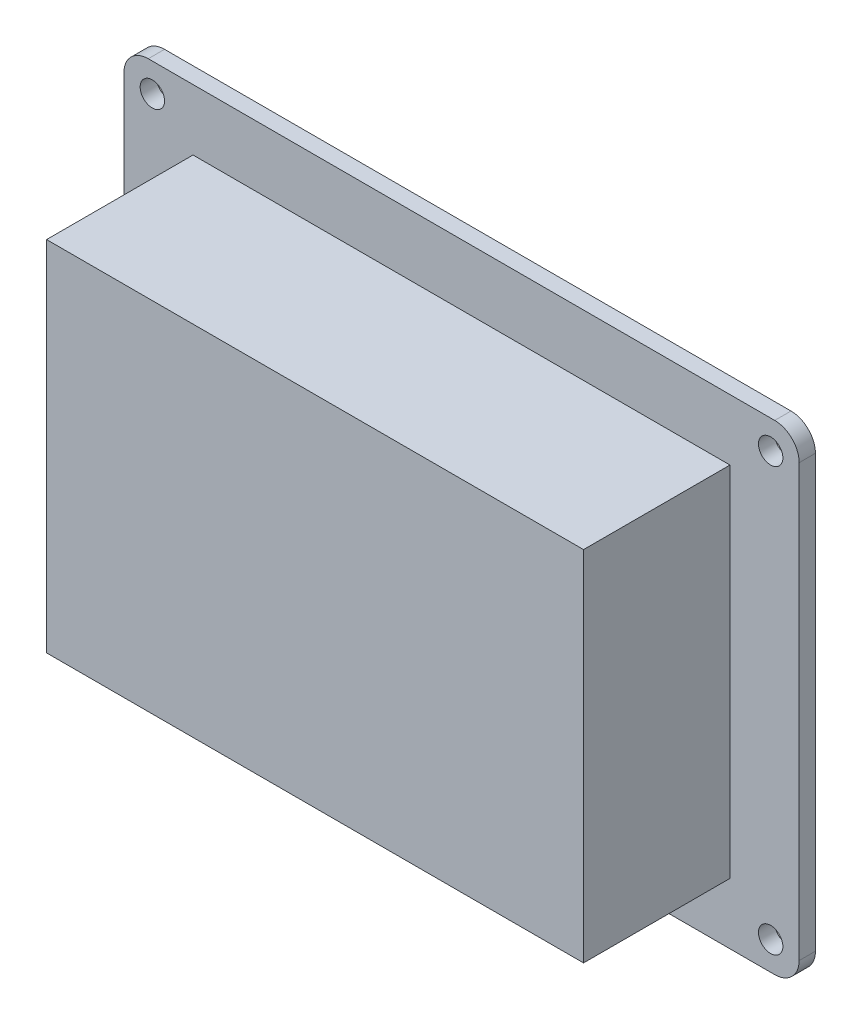
ISO-10303-21;
HEADER;
FILE_DESCRIPTION(('STEP AP214'),'2;1');
FILE_NAME('part.step','',(''),(''),'','','');
FILE_SCHEMA(('AUTOMOTIVE_DESIGN { 1 0 10303 214 1 1 1 1 }'));
ENDSEC;
DATA;
#1=APPLICATION_CONTEXT('core data for automotive mechanical design processes');
#2=APPLICATION_PROTOCOL_DEFINITION('international standard','automotive_design',2000,#1);
#3=PRODUCT_CONTEXT('',#1,'mechanical');
#4=PRODUCT('Part','Part','',(#3));
#5=PRODUCT_RELATED_PRODUCT_CATEGORY('part','',(#4));
#6=PRODUCT_DEFINITION_FORMATION('','',#4);
#7=PRODUCT_DEFINITION_CONTEXT('part definition',#1,'design');
#8=PRODUCT_DEFINITION('design','',#6,#7);
#9=PRODUCT_DEFINITION_SHAPE('','',#8);
#10=(LENGTH_UNIT() NAMED_UNIT(*) SI_UNIT(.MILLI.,.METRE.));
#11=(NAMED_UNIT(*) PLANE_ANGLE_UNIT() SI_UNIT($,.RADIAN.));
#12=(NAMED_UNIT(*) SI_UNIT($,.STERADIAN.) SOLID_ANGLE_UNIT());
#13=UNCERTAINTY_MEASURE_WITH_UNIT(LENGTH_MEASURE(1.E-05),#10,'distance_accuracy_value','');
#14=(GEOMETRIC_REPRESENTATION_CONTEXT(3) GLOBAL_UNCERTAINTY_ASSIGNED_CONTEXT((#13)) GLOBAL_UNIT_ASSIGNED_CONTEXT((#10,
#11,#12)) REPRESENTATION_CONTEXT('',''));
#15=CARTESIAN_POINT('',(0.,0.,0.));
#16=DIRECTION('',(0.,0.,1.));
#17=DIRECTION('',(1.,0.,0.));
#18=AXIS2_PLACEMENT_3D('',#15,#16,#17);
#19=CARTESIAN_POINT('',(0.,0.,2.));
#20=DIRECTION('',(0.,0.,-1.));
#21=DIRECTION('',(-1.,0.,0.));
#22=AXIS2_PLACEMENT_3D('',#19,#20,#21);
#23=PLANE('',#22);
#24=DIRECTION('',(0.,1.,0.));
#25=VECTOR('',#24,1.);
#26=CARTESIAN_POINT('',(83.,0.,2.));
#27=LINE('',#26,#25);
#28=CARTESIAN_POINT('',(83.,3.,2.));
#29=VERTEX_POINT('',#28);
#30=CARTESIAN_POINT('',(83.,56.,2.));
#31=VERTEX_POINT('',#30);
#32=EDGE_CURVE('E181',#29,#31,#27,.T.);
#33=ORIENTED_EDGE('',*,*,#32,.T.);
#34=CARTESIAN_POINT('',(80.,56.,2.));
#35=DIRECTION('',(0.,0.,-1.));
#36=DIRECTION('',(-1.,0.,0.));
#37=AXIS2_PLACEMENT_3D('',#34,#35,#36);
#38=CIRCLE('',#37,3.);
#39=CARTESIAN_POINT('',(80.,59.,2.));
#40=VERTEX_POINT('',#39);
#41=EDGE_CURVE('E221',#31,#40,#38,.F.);
#42=ORIENTED_EDGE('',*,*,#41,.T.);
#43=DIRECTION('',(-1.,0.,0.));
#44=VECTOR('',#43,1.);
#45=CARTESIAN_POINT('',(0.,59.,2.));
#46=LINE('',#45,#44);
#47=CARTESIAN_POINT('',(3.,59.,2.));
#48=VERTEX_POINT('',#47);
#49=EDGE_CURVE('E184',#40,#48,#46,.T.);
#50=ORIENTED_EDGE('',*,*,#49,.T.);
#51=CARTESIAN_POINT('',(3.,56.,2.));
#52=DIRECTION('',(0.,0.,-1.));
#53=DIRECTION('',(-1.,0.,0.));
#54=AXIS2_PLACEMENT_3D('',#51,#52,#53);
#55=CIRCLE('',#54,3.);
#56=CARTESIAN_POINT('',(0.,56.,2.));
#57=VERTEX_POINT('',#56);
#58=EDGE_CURVE('E215',#48,#57,#55,.F.);
#59=ORIENTED_EDGE('',*,*,#58,.T.);
#60=DIRECTION('',(0.,-1.,0.));
#61=VECTOR('',#60,1.);
#62=CARTESIAN_POINT('',(0.,0.,2.));
#63=LINE('',#62,#61);
#64=CARTESIAN_POINT('',(0.,3.,2.));
#65=VERTEX_POINT('',#64);
#66=EDGE_CURVE('E174',#57,#65,#63,.T.);
#67=ORIENTED_EDGE('',*,*,#66,.T.);
#68=CARTESIAN_POINT('',(3.,3.,2.));
#69=DIRECTION('',(0.,0.,-1.));
#70=DIRECTION('',(-1.,0.,0.));
#71=AXIS2_PLACEMENT_3D('',#68,#69,#70);
#72=CIRCLE('',#71,3.);
#73=CARTESIAN_POINT('',(3.,0.,2.));
#74=VERTEX_POINT('',#73);
#75=EDGE_CURVE('E217',#65,#74,#72,.F.);
#76=ORIENTED_EDGE('',*,*,#75,.T.);
#77=DIRECTION('',(1.,0.,0.));
#78=VECTOR('',#77,1.);
#79=CARTESIAN_POINT('',(0.,0.,2.));
#80=LINE('',#79,#78);
#81=CARTESIAN_POINT('',(80.,0.,2.));
#82=VERTEX_POINT('',#81);
#83=EDGE_CURVE('E177',#74,#82,#80,.T.);
#84=ORIENTED_EDGE('',*,*,#83,.T.);
#85=CARTESIAN_POINT('',(80.,3.,2.));
#86=DIRECTION('',(0.,0.,-1.));
#87=DIRECTION('',(-1.,0.,0.));
#88=AXIS2_PLACEMENT_3D('',#85,#86,#87);
#89=CIRCLE('',#88,3.);
#90=EDGE_CURVE('E219',#82,#29,#89,.F.);
#91=ORIENTED_EDGE('',*,*,#90,.T.);
#92=EDGE_LOOP('',(#33,#42,#50,#59,#67,#76,#84,#91));
#93=FACE_BOUND('',#92,.T.);
#94=CARTESIAN_POINT('',(79.5,55.5,2.));
#95=DIRECTION('',(0.,0.,1.));
#96=DIRECTION('',(1.,0.,0.));
#97=AXIS2_PLACEMENT_3D('',#94,#95,#96);
#98=CIRCLE('',#97,1.5);
#99=CARTESIAN_POINT('',(81.,55.5,2.));
#100=VERTEX_POINT('',#99);
#101=EDGE_CURVE('E158',#100,#100,#98,.T.);
#102=ORIENTED_EDGE('',*,*,#101,.F.);
#103=EDGE_LOOP('',(#102));
#104=FACE_BOUND('',#103,.T.);
#105=CARTESIAN_POINT('',(3.50000000000002,55.5,2.));
#106=DIRECTION('',(0.,0.,1.));
#107=DIRECTION('',(1.,0.,0.));
#108=AXIS2_PLACEMENT_3D('',#105,#106,#107);
#109=CIRCLE('',#108,1.5);
#110=CARTESIAN_POINT('',(5.00000000000002,55.5,2.));
#111=VERTEX_POINT('',#110);
#112=EDGE_CURVE('E162',#111,#111,#109,.T.);
#113=ORIENTED_EDGE('',*,*,#112,.F.);
#114=EDGE_LOOP('',(#113));
#115=FACE_BOUND('',#114,.T.);
#116=CARTESIAN_POINT('',(79.5,3.5,2.));
#117=DIRECTION('',(0.,0.,-1.));
#118=DIRECTION('',(1.,0.,0.));
#119=AXIS2_PLACEMENT_3D('',#116,#117,#118);
#120=CIRCLE('',#119,1.5);
#121=CARTESIAN_POINT('',(81.,3.5,2.));
#122=VERTEX_POINT('',#121);
#123=EDGE_CURVE('E144',#122,#122,#120,.T.);
#124=ORIENTED_EDGE('',*,*,#123,.T.);
#125=EDGE_LOOP('',(#124));
#126=FACE_BOUND('',#125,.T.);
#127=CARTESIAN_POINT('',(3.50000000000002,3.5,2.));
#128=DIRECTION('',(0.,0.,-1.));
#129=DIRECTION('',(1.,0.,0.));
#130=AXIS2_PLACEMENT_3D('',#127,#128,#129);
#131=CIRCLE('',#130,1.5);
#132=CARTESIAN_POINT('',(5.00000000000002,3.5,2.));
#133=VERTEX_POINT('',#132);
#134=EDGE_CURVE('E153',#133,#133,#131,.T.);
#135=ORIENTED_EDGE('',*,*,#134,.T.);
#136=EDGE_LOOP('',(#135));
#137=FACE_BOUND('',#136,.T.);
#138=DIRECTION('',(0.,-1.,0.));
#139=VECTOR('',#138,1.);
#140=CARTESIAN_POINT('',(8.50000000000001,51.5,2.));
#141=LINE('',#140,#139);
#142=CARTESIAN_POINT('',(8.50000000000001,51.5,2.));
#143=VERTEX_POINT('',#142);
#144=CARTESIAN_POINT('',(8.50000000000001,7.5,2.));
#145=VERTEX_POINT('',#144);
#146=EDGE_CURVE('E143',#143,#145,#141,.T.);
#147=ORIENTED_EDGE('',*,*,#146,.F.);
#148=DIRECTION('',(-1.,0.,0.));
#149=VECTOR('',#148,1.);
#150=CARTESIAN_POINT('',(8.50000000000001,51.5,2.));
#151=LINE('',#150,#149);
#152=CARTESIAN_POINT('',(74.5,51.5,2.));
#153=VERTEX_POINT('',#152);
#154=EDGE_CURVE('E140',#153,#143,#151,.T.);
#155=ORIENTED_EDGE('',*,*,#154,.F.);
#156=DIRECTION('',(0.,1.,0.));
#157=VECTOR('',#156,1.);
#158=CARTESIAN_POINT('',(74.5,51.5,2.));
#159=LINE('',#158,#157);
#160=CARTESIAN_POINT('',(74.5,7.5,2.));
#161=VERTEX_POINT('',#160);
#162=EDGE_CURVE('E55',#161,#153,#159,.T.);
#163=ORIENTED_EDGE('',*,*,#162,.F.);
#164=DIRECTION('',(1.,0.,0.));
#165=VECTOR('',#164,1.);
#166=CARTESIAN_POINT('',(8.50000000000001,7.5,2.));
#167=LINE('',#166,#165);
#168=EDGE_CURVE('E50',#145,#161,#167,.T.);
#169=ORIENTED_EDGE('',*,*,#168,.F.);
#170=EDGE_LOOP('',(#147,#155,#163,#169));
#171=FACE_BOUND('',#170,.T.);
#172=ADVANCED_FACE('F35',(#93,#104,#115,#126,#137,#171),#23,.F.);
#173=CARTESIAN_POINT('',(0.,0.,2.));
#174=DIRECTION('',(1.,0.,0.));
#175=DIRECTION('',(0.,0.,-1.));
#176=AXIS2_PLACEMENT_3D('',#173,#174,#175);
#177=PLANE('',#176);
#178=DIRECTION('',(0.,-1.,0.));
#179=VECTOR('',#178,1.);
#180=CARTESIAN_POINT('',(0.,0.,0.));
#181=LINE('',#180,#179);
#182=CARTESIAN_POINT('',(0.,56.,0.));
#183=VERTEX_POINT('',#182);
#184=CARTESIAN_POINT('',(0.,3.,0.));
#185=VERTEX_POINT('',#184);
#186=EDGE_CURVE('E165',#183,#185,#181,.T.);
#187=ORIENTED_EDGE('',*,*,#186,.T.);
#188=DIRECTION('',(0.,0.,-1.));
#189=VECTOR('',#188,1.);
#190=CARTESIAN_POINT('',(0.,3.,2.));
#191=LINE('',#190,#189);
#192=EDGE_CURVE('E11',#185,#65,#191,.F.);
#193=ORIENTED_EDGE('',*,*,#192,.T.);
#194=ORIENTED_EDGE('',*,*,#66,.F.);
#195=DIRECTION('',(0.,0.,-1.));
#196=VECTOR('',#195,1.);
#197=CARTESIAN_POINT('',(0.,56.,2.));
#198=LINE('',#197,#196);
#199=EDGE_CURVE('E43',#57,#183,#198,.T.);
#200=ORIENTED_EDGE('',*,*,#199,.T.);
#201=EDGE_LOOP('',(#187,#193,#194,#200));
#202=FACE_BOUND('',#201,.T.);
#203=ADVANCED_FACE('F232',(#202),#177,.F.);
#204=CARTESIAN_POINT('',(0.,0.,2.));
#205=DIRECTION('',(0.,1.,0.));
#206=DIRECTION('',(0.,0.,1.));
#207=AXIS2_PLACEMENT_3D('',#204,#205,#206);
#208=PLANE('',#207);
#209=DIRECTION('',(1.,0.,0.));
#210=VECTOR('',#209,1.);
#211=CARTESIAN_POINT('',(0.,0.,0.));
#212=LINE('',#211,#210);
#213=CARTESIAN_POINT('',(3.,0.,0.));
#214=VERTEX_POINT('',#213);
#215=CARTESIAN_POINT('',(80.,0.,0.));
#216=VERTEX_POINT('',#215);
#217=EDGE_CURVE('E190',#214,#216,#212,.T.);
#218=ORIENTED_EDGE('',*,*,#217,.T.);
#219=DIRECTION('',(0.,0.,-1.));
#220=VECTOR('',#219,1.);
#221=CARTESIAN_POINT('',(80.,0.,2.));
#222=LINE('',#221,#220);
#223=EDGE_CURVE('E226',#216,#82,#222,.F.);
#224=ORIENTED_EDGE('',*,*,#223,.T.);
#225=ORIENTED_EDGE('',*,*,#83,.F.);
#226=DIRECTION('',(0.,0.,-1.));
#227=VECTOR('',#226,1.);
#228=CARTESIAN_POINT('',(3.,0.,2.));
#229=LINE('',#228,#227);
#230=EDGE_CURVE('E223',#74,#214,#229,.T.);
#231=ORIENTED_EDGE('',*,*,#230,.T.);
#232=EDGE_LOOP('',(#218,#224,#225,#231));
#233=FACE_BOUND('',#232,.T.);
#234=ADVANCED_FACE('F246',(#233),#208,.F.);
#235=CARTESIAN_POINT('',(83.,0.,2.));
#236=DIRECTION('',(-1.,0.,0.));
#237=DIRECTION('',(0.,-1.,0.));
#238=AXIS2_PLACEMENT_3D('',#235,#236,#237);
#239=PLANE('',#238);
#240=DIRECTION('',(0.,1.,0.));
#241=VECTOR('',#240,1.);
#242=CARTESIAN_POINT('',(83.,0.,0.));
#243=LINE('',#242,#241);
#244=CARTESIAN_POINT('',(83.,3.,0.));
#245=VERTEX_POINT('',#244);
#246=CARTESIAN_POINT('',(83.,56.,0.));
#247=VERTEX_POINT('',#246);
#248=EDGE_CURVE('E193',#245,#247,#243,.T.);
#249=ORIENTED_EDGE('',*,*,#248,.T.);
#250=DIRECTION('',(0.,0.,-1.));
#251=VECTOR('',#250,1.);
#252=CARTESIAN_POINT('',(83.,56.,2.));
#253=LINE('',#252,#251);
#254=EDGE_CURVE('E213',#247,#31,#253,.F.);
#255=ORIENTED_EDGE('',*,*,#254,.T.);
#256=ORIENTED_EDGE('',*,*,#32,.F.);
#257=DIRECTION('',(0.,0.,-1.));
#258=VECTOR('',#257,1.);
#259=CARTESIAN_POINT('',(83.,3.,2.));
#260=LINE('',#259,#258);
#261=EDGE_CURVE('E210',#29,#245,#260,.T.);
#262=ORIENTED_EDGE('',*,*,#261,.T.);
#263=EDGE_LOOP('',(#249,#255,#256,#262));
#264=FACE_BOUND('',#263,.T.);
#265=ADVANCED_FACE('F257',(#264),#239,.F.);
#266=CARTESIAN_POINT('',(0.,59.,2.));
#267=DIRECTION('',(0.,-1.,0.));
#268=DIRECTION('',(0.,0.,-1.));
#269=AXIS2_PLACEMENT_3D('',#266,#267,#268);
#270=PLANE('',#269);
#271=ORIENTED_EDGE('',*,*,#49,.F.);
#272=DIRECTION('',(0.,0.,-1.));
#273=VECTOR('',#272,1.);
#274=CARTESIAN_POINT('',(80.,59.,2.));
#275=LINE('',#274,#273);
#276=CARTESIAN_POINT('',(80.,59.,0.));
#277=VERTEX_POINT('',#276);
#278=EDGE_CURVE('E199',#40,#277,#275,.T.);
#279=ORIENTED_EDGE('',*,*,#278,.T.);
#280=DIRECTION('',(-1.,0.,0.));
#281=VECTOR('',#280,1.);
#282=CARTESIAN_POINT('',(0.,59.,0.));
#283=LINE('',#282,#281);
#284=CARTESIAN_POINT('',(3.,59.,0.));
#285=VERTEX_POINT('',#284);
#286=EDGE_CURVE('E178',#277,#285,#283,.T.);
#287=ORIENTED_EDGE('',*,*,#286,.T.);
#288=DIRECTION('',(0.,0.,-1.));
#289=VECTOR('',#288,1.);
#290=CARTESIAN_POINT('',(3.,59.,2.));
#291=LINE('',#290,#289);
#292=EDGE_CURVE('E187',#285,#48,#291,.F.);
#293=ORIENTED_EDGE('',*,*,#292,.T.);
#294=EDGE_LOOP('',(#271,#279,#287,#293));
#295=FACE_BOUND('',#294,.T.);
#296=ADVANCED_FACE('F265',(#295),#270,.F.);
#297=CARTESIAN_POINT('',(0.,0.,0.));
#298=DIRECTION('',(0.,0.,-1.));
#299=DIRECTION('',(-1.,0.,0.));
#300=AXIS2_PLACEMENT_3D('',#297,#298,#299);
#301=PLANE('',#300);
#302=CARTESIAN_POINT('',(3.50000000000002,3.5,0.));
#303=DIRECTION('',(0.,0.,-1.));
#304=DIRECTION('',(-1.,0.,0.));
#305=AXIS2_PLACEMENT_3D('',#302,#303,#304);
#306=CIRCLE('',#305,1.5);
#307=CARTESIAN_POINT('',(2.00000000000002,3.5,0.));
#308=VERTEX_POINT('',#307);
#309=EDGE_CURVE('E156',#308,#308,#306,.T.);
#310=ORIENTED_EDGE('',*,*,#309,.F.);
#311=EDGE_LOOP('',(#310));
#312=FACE_BOUND('',#311,.T.);
#313=CARTESIAN_POINT('',(79.5,3.5,0.));
#314=DIRECTION('',(0.,0.,-1.));
#315=DIRECTION('',(-1.,0.,0.));
#316=AXIS2_PLACEMENT_3D('',#313,#314,#315);
#317=CIRCLE('',#316,1.5);
#318=CARTESIAN_POINT('',(78.,3.5,0.));
#319=VERTEX_POINT('',#318);
#320=EDGE_CURVE('E147',#319,#319,#317,.T.);
#321=ORIENTED_EDGE('',*,*,#320,.F.);
#322=EDGE_LOOP('',(#321));
#323=FACE_BOUND('',#322,.T.);
#324=CARTESIAN_POINT('',(3.50000000000002,55.5,0.));
#325=DIRECTION('',(0.,0.,-1.));
#326=DIRECTION('',(-1.,0.,0.));
#327=AXIS2_PLACEMENT_3D('',#324,#325,#326);
#328=CIRCLE('',#327,1.5);
#329=CARTESIAN_POINT('',(2.00000000000002,55.5,0.));
#330=VERTEX_POINT('',#329);
#331=EDGE_CURVE('E166',#330,#330,#328,.F.);
#332=ORIENTED_EDGE('',*,*,#331,.T.);
#333=EDGE_LOOP('',(#332));
#334=FACE_BOUND('',#333,.T.);
#335=CARTESIAN_POINT('',(79.5,55.5,0.));
#336=DIRECTION('',(0.,0.,-1.));
#337=DIRECTION('',(-1.,0.,0.));
#338=AXIS2_PLACEMENT_3D('',#335,#336,#337);
#339=CIRCLE('',#338,1.5);
#340=CARTESIAN_POINT('',(78.,55.5,0.));
#341=VERTEX_POINT('',#340);
#342=EDGE_CURVE('E169',#341,#341,#339,.F.);
#343=ORIENTED_EDGE('',*,*,#342,.T.);
#344=EDGE_LOOP('',(#343));
#345=FACE_BOUND('',#344,.T.);
#346=ORIENTED_EDGE('',*,*,#286,.F.);
#347=CARTESIAN_POINT('',(80.,56.,0.));
#348=DIRECTION('',(0.,0.,-1.));
#349=DIRECTION('',(-1.,0.,0.));
#350=AXIS2_PLACEMENT_3D('',#347,#348,#349);
#351=CIRCLE('',#350,3.);
#352=EDGE_CURVE('E208',#277,#247,#351,.T.);
#353=ORIENTED_EDGE('',*,*,#352,.T.);
#354=ORIENTED_EDGE('',*,*,#248,.F.);
#355=CARTESIAN_POINT('',(80.,3.,0.));
#356=DIRECTION('',(0.,0.,-1.));
#357=DIRECTION('',(-1.,0.,0.));
#358=AXIS2_PLACEMENT_3D('',#355,#356,#357);
#359=CIRCLE('',#358,3.);
#360=EDGE_CURVE('E206',#245,#216,#359,.T.);
#361=ORIENTED_EDGE('',*,*,#360,.T.);
#362=ORIENTED_EDGE('',*,*,#217,.F.);
#363=CARTESIAN_POINT('',(3.,3.,0.));
#364=DIRECTION('',(0.,0.,-1.));
#365=DIRECTION('',(-1.,0.,0.));
#366=AXIS2_PLACEMENT_3D('',#363,#364,#365);
#367=CIRCLE('',#366,3.);
#368=EDGE_CURVE('E204',#214,#185,#367,.T.);
#369=ORIENTED_EDGE('',*,*,#368,.T.);
#370=ORIENTED_EDGE('',*,*,#186,.F.);
#371=CARTESIAN_POINT('',(3.,56.,0.));
#372=DIRECTION('',(0.,0.,-1.));
#373=DIRECTION('',(-1.,0.,0.));
#374=AXIS2_PLACEMENT_3D('',#371,#372,#373);
#375=CIRCLE('',#374,3.);
#376=EDGE_CURVE('E202',#183,#285,#375,.T.);
#377=ORIENTED_EDGE('',*,*,#376,.T.);
#378=EDGE_LOOP('',(#346,#353,#354,#361,#362,#369,#370,#377));
#379=FACE_BOUND('',#378,.T.);
#380=ADVANCED_FACE('F238',(#312,#323,#334,#345,#379),#301,.T.);
#381=CARTESIAN_POINT('',(80.,56.,2.));
#382=DIRECTION('',(0.,0.,-1.));
#383=DIRECTION('',(-1.,0.,0.));
#384=AXIS2_PLACEMENT_3D('',#381,#382,#383);
#385=CYLINDRICAL_SURFACE('',#384,3.);
#386=ORIENTED_EDGE('',*,*,#41,.F.);
#387=ORIENTED_EDGE('',*,*,#254,.F.);
#388=ORIENTED_EDGE('',*,*,#352,.F.);
#389=ORIENTED_EDGE('',*,*,#278,.F.);
#390=EDGE_LOOP('',(#386,#387,#388,#389));
#391=FACE_BOUND('',#390,.T.);
#392=ADVANCED_FACE('F262',(#391),#385,.T.);
#393=CARTESIAN_POINT('',(80.,3.,2.));
#394=DIRECTION('',(0.,0.,-1.));
#395=DIRECTION('',(-1.,0.,0.));
#396=AXIS2_PLACEMENT_3D('',#393,#394,#395);
#397=CYLINDRICAL_SURFACE('',#396,3.);
#398=ORIENTED_EDGE('',*,*,#90,.F.);
#399=ORIENTED_EDGE('',*,*,#223,.F.);
#400=ORIENTED_EDGE('',*,*,#360,.F.);
#401=ORIENTED_EDGE('',*,*,#261,.F.);
#402=EDGE_LOOP('',(#398,#399,#400,#401));
#403=FACE_BOUND('',#402,.T.);
#404=ADVANCED_FACE('F254',(#403),#397,.T.);
#405=CARTESIAN_POINT('',(3.,3.,2.));
#406=DIRECTION('',(0.,0.,-1.));
#407=DIRECTION('',(-1.,0.,0.));
#408=AXIS2_PLACEMENT_3D('',#405,#406,#407);
#409=CYLINDRICAL_SURFACE('',#408,3.);
#410=ORIENTED_EDGE('',*,*,#75,.F.);
#411=ORIENTED_EDGE('',*,*,#192,.F.);
#412=ORIENTED_EDGE('',*,*,#368,.F.);
#413=ORIENTED_EDGE('',*,*,#230,.F.);
#414=EDGE_LOOP('',(#410,#411,#412,#413));
#415=FACE_BOUND('',#414,.T.);
#416=ADVANCED_FACE('F243',(#415),#409,.T.);
#417=CARTESIAN_POINT('',(3.,56.,2.));
#418=DIRECTION('',(0.,0.,-1.));
#419=DIRECTION('',(-1.,0.,0.));
#420=AXIS2_PLACEMENT_3D('',#417,#418,#419);
#421=CYLINDRICAL_SURFACE('',#420,3.);
#422=ORIENTED_EDGE('',*,*,#58,.F.);
#423=ORIENTED_EDGE('',*,*,#292,.F.);
#424=ORIENTED_EDGE('',*,*,#376,.F.);
#425=ORIENTED_EDGE('',*,*,#199,.F.);
#426=EDGE_LOOP('',(#422,#423,#424,#425));
#427=FACE_BOUND('',#426,.T.);
#428=ADVANCED_FACE('F37',(#427),#421,.T.);
#429=CARTESIAN_POINT('',(79.5,55.5,-0.00100000000000013));
#430=DIRECTION('',(0.,0.,1.));
#431=DIRECTION('',(1.,0.,0.));
#432=AXIS2_PLACEMENT_3D('',#429,#430,#431);
#433=CYLINDRICAL_SURFACE('',#432,1.5);
#434=ORIENTED_EDGE('',*,*,#342,.F.);
#435=EDGE_LOOP('',(#434));
#436=FACE_BOUND('',#435,.T.);
#437=ORIENTED_EDGE('',*,*,#101,.T.);
#438=EDGE_LOOP('',(#437));
#439=FACE_BOUND('',#438,.T.);
#440=ADVANCED_FACE('F268',(#436,#439),#433,.F.);
#441=CARTESIAN_POINT('',(3.50000000000002,55.5,-0.00100000000000013));
#442=DIRECTION('',(0.,0.,1.));
#443=DIRECTION('',(1.,0.,0.));
#444=AXIS2_PLACEMENT_3D('',#441,#442,#443);
#445=CYLINDRICAL_SURFACE('',#444,1.5);
#446=ORIENTED_EDGE('',*,*,#331,.F.);
#447=EDGE_LOOP('',(#446));
#448=FACE_BOUND('',#447,.T.);
#449=ORIENTED_EDGE('',*,*,#112,.T.);
#450=EDGE_LOOP('',(#449));
#451=FACE_BOUND('',#450,.T.);
#452=ADVANCED_FACE('F273',(#448,#451),#445,.F.);
#453=CARTESIAN_POINT('',(79.5,3.5,-0.00100000000000013));
#454=DIRECTION('',(0.,0.,1.));
#455=DIRECTION('',(1.,0.,0.));
#456=AXIS2_PLACEMENT_3D('',#453,#454,#455);
#457=CYLINDRICAL_SURFACE('',#456,1.5);
#458=ORIENTED_EDGE('',*,*,#320,.T.);
#459=EDGE_LOOP('',(#458));
#460=FACE_BOUND('',#459,.T.);
#461=ORIENTED_EDGE('',*,*,#123,.F.);
#462=EDGE_LOOP('',(#461));
#463=FACE_BOUND('',#462,.T.);
#464=ADVANCED_FACE('F323',(#460,#463),#457,.F.);
#465=CARTESIAN_POINT('',(3.50000000000002,3.5,-0.00100000000000013));
#466=DIRECTION('',(0.,0.,1.));
#467=DIRECTION('',(1.,0.,0.));
#468=AXIS2_PLACEMENT_3D('',#465,#466,#467);
#469=CYLINDRICAL_SURFACE('',#468,1.5);
#470=ORIENTED_EDGE('',*,*,#309,.T.);
#471=EDGE_LOOP('',(#470));
#472=FACE_BOUND('',#471,.T.);
#473=ORIENTED_EDGE('',*,*,#134,.F.);
#474=EDGE_LOOP('',(#473));
#475=FACE_BOUND('',#474,.T.);
#476=ADVANCED_FACE('F340',(#472,#475),#469,.F.);
#477=CARTESIAN_POINT('',(8.50000000000001,51.5,20.));
#478=DIRECTION('',(1.,0.,0.));
#479=DIRECTION('',(0.,1.,0.));
#480=AXIS2_PLACEMENT_3D('',#477,#478,#479);
#481=PLANE('',#480);
#482=ORIENTED_EDGE('',*,*,#146,.T.);
#483=DIRECTION('',(0.,0.,-1.));
#484=VECTOR('',#483,1.);
#485=CARTESIAN_POINT('',(8.50000000000001,7.5,20.));
#486=LINE('',#485,#484);
#487=CARTESIAN_POINT('',(8.50000000000001,7.5,20.));
#488=VERTEX_POINT('',#487);
#489=EDGE_CURVE('E124',#488,#145,#486,.T.);
#490=ORIENTED_EDGE('',*,*,#489,.F.);
#491=DIRECTION('',(0.,-1.,0.));
#492=VECTOR('',#491,1.);
#493=CARTESIAN_POINT('',(8.50000000000001,51.5,20.));
#494=LINE('',#493,#492);
#495=CARTESIAN_POINT('',(8.50000000000001,51.5,20.));
#496=VERTEX_POINT('',#495);
#497=EDGE_CURVE('E131',#496,#488,#494,.T.);
#498=ORIENTED_EDGE('',*,*,#497,.F.);
#499=DIRECTION('',(0.,0.,-1.));
#500=VECTOR('',#499,1.);
#501=CARTESIAN_POINT('',(8.50000000000001,51.5,20.));
#502=LINE('',#501,#500);
#503=EDGE_CURVE('E414',#496,#143,#502,.T.);
#504=ORIENTED_EDGE('',*,*,#503,.T.);
#505=EDGE_LOOP('',(#482,#490,#498,#504));
#506=FACE_BOUND('',#505,.T.);
#507=ADVANCED_FACE('F142',(#506),#481,.F.);
#508=CARTESIAN_POINT('',(8.50000000000001,7.5,20.));
#509=DIRECTION('',(0.,1.,0.));
#510=DIRECTION('',(0.,0.,1.));
#511=AXIS2_PLACEMENT_3D('',#508,#509,#510);
#512=PLANE('',#511);
#513=ORIENTED_EDGE('',*,*,#168,.T.);
#514=DIRECTION('',(0.,0.,-1.));
#515=VECTOR('',#514,1.);
#516=CARTESIAN_POINT('',(74.5,7.5,20.));
#517=LINE('',#516,#515);
#518=CARTESIAN_POINT('',(74.5,7.5,20.));
#519=VERTEX_POINT('',#518);
#520=EDGE_CURVE('E127',#519,#161,#517,.T.);
#521=ORIENTED_EDGE('',*,*,#520,.F.);
#522=DIRECTION('',(1.,0.,0.));
#523=VECTOR('',#522,1.);
#524=CARTESIAN_POINT('',(8.50000000000001,7.5,20.));
#525=LINE('',#524,#523);
#526=EDGE_CURVE('E120',#488,#519,#525,.T.);
#527=ORIENTED_EDGE('',*,*,#526,.F.);
#528=ORIENTED_EDGE('',*,*,#489,.T.);
#529=EDGE_LOOP('',(#513,#521,#527,#528));
#530=FACE_BOUND('',#529,.T.);
#531=ADVANCED_FACE('F122',(#530),#512,.F.);
#532=CARTESIAN_POINT('',(74.5,51.5,20.));
#533=DIRECTION('',(-1.,0.,0.));
#534=DIRECTION('',(0.,0.,1.));
#535=AXIS2_PLACEMENT_3D('',#532,#533,#534);
#536=PLANE('',#535);
#537=ORIENTED_EDGE('',*,*,#162,.T.);
#538=DIRECTION('',(0.,0.,-1.));
#539=VECTOR('',#538,1.);
#540=CARTESIAN_POINT('',(74.5,51.5,20.));
#541=LINE('',#540,#539);
#542=CARTESIAN_POINT('',(74.5,51.5,20.));
#543=VERTEX_POINT('',#542);
#544=EDGE_CURVE('E149',#543,#153,#541,.T.);
#545=ORIENTED_EDGE('',*,*,#544,.F.);
#546=DIRECTION('',(0.,1.,0.));
#547=VECTOR('',#546,1.);
#548=CARTESIAN_POINT('',(74.5,51.5,20.));
#549=LINE('',#548,#547);
#550=EDGE_CURVE('E130',#519,#543,#549,.T.);
#551=ORIENTED_EDGE('',*,*,#550,.F.);
#552=ORIENTED_EDGE('',*,*,#520,.T.);
#553=EDGE_LOOP('',(#537,#545,#551,#552));
#554=FACE_BOUND('',#553,.T.);
#555=ADVANCED_FACE('F374',(#554),#536,.F.);
#556=CARTESIAN_POINT('',(8.50000000000001,51.5,20.));
#557=DIRECTION('',(0.,-1.,0.));
#558=DIRECTION('',(1.,0.,0.));
#559=AXIS2_PLACEMENT_3D('',#556,#557,#558);
#560=PLANE('',#559);
#561=ORIENTED_EDGE('',*,*,#154,.T.);
#562=ORIENTED_EDGE('',*,*,#503,.F.);
#563=DIRECTION('',(-1.,0.,0.));
#564=VECTOR('',#563,1.);
#565=CARTESIAN_POINT('',(8.50000000000001,51.5,20.));
#566=LINE('',#565,#564);
#567=EDGE_CURVE('E136',#543,#496,#566,.T.);
#568=ORIENTED_EDGE('',*,*,#567,.F.);
#569=ORIENTED_EDGE('',*,*,#544,.T.);
#570=EDGE_LOOP('',(#561,#562,#568,#569));
#571=FACE_BOUND('',#570,.T.);
#572=ADVANCED_FACE('F385',(#571),#560,.F.);
#573=CARTESIAN_POINT('',(0.,0.,20.));
#574=DIRECTION('',(0.,0.,1.));
#575=DIRECTION('',(1.,0.,0.));
#576=AXIS2_PLACEMENT_3D('',#573,#574,#575);
#577=PLANE('',#576);
#578=ORIENTED_EDGE('',*,*,#497,.T.);
#579=ORIENTED_EDGE('',*,*,#526,.T.);
#580=ORIENTED_EDGE('',*,*,#550,.T.);
#581=ORIENTED_EDGE('',*,*,#567,.T.);
#582=EDGE_LOOP('',(#578,#579,#580,#581));
#583=FACE_BOUND('',#582,.T.);
#584=ADVANCED_FACE('F134',(#583),#577,.T.);
#585=CLOSED_SHELL('',(#172,#203,#234,#265,#296,#380,#392,#404,#416,#428,#440,#452,#464,#476,
#507,#531,#555,#572,#584));
#586=MANIFOLD_SOLID_BREP('B2',#585);
#587=ADVANCED_BREP_SHAPE_REPRESENTATION('',(#18,#586),#14);
#588=SHAPE_DEFINITION_REPRESENTATION(#9,#587);
ENDSEC;
END-ISO-10303-21;
